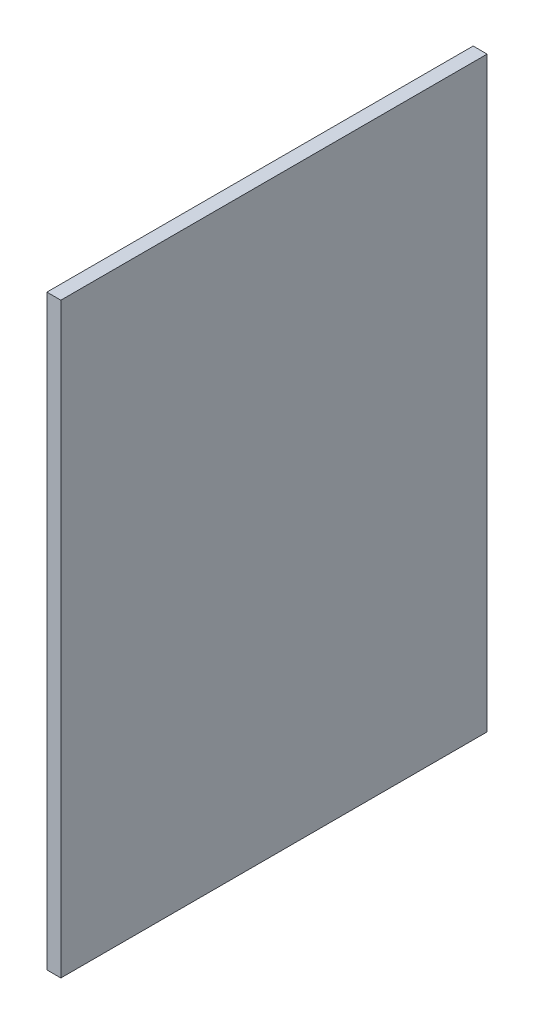
ISO-10303-21;
HEADER;
FILE_DESCRIPTION(('STEP AP214'),'2;1');
FILE_NAME('part.step','',(''),(''),'','','');
FILE_SCHEMA(('AUTOMOTIVE_DESIGN { 1 0 10303 214 1 1 1 1 }'));
ENDSEC;
DATA;
#1=APPLICATION_CONTEXT('core data for automotive mechanical design processes');
#2=APPLICATION_PROTOCOL_DEFINITION('international standard','automotive_design',2000,#1);
#3=PRODUCT_CONTEXT('',#1,'mechanical');
#4=PRODUCT('Part','Part','',(#3));
#5=PRODUCT_RELATED_PRODUCT_CATEGORY('part','',(#4));
#6=PRODUCT_DEFINITION_FORMATION('','',#4);
#7=PRODUCT_DEFINITION_CONTEXT('part definition',#1,'design');
#8=PRODUCT_DEFINITION('design','',#6,#7);
#9=PRODUCT_DEFINITION_SHAPE('','',#8);
#10=(LENGTH_UNIT() NAMED_UNIT(*) SI_UNIT(.MILLI.,.METRE.));
#11=(NAMED_UNIT(*) PLANE_ANGLE_UNIT() SI_UNIT($,.RADIAN.));
#12=(NAMED_UNIT(*) SI_UNIT($,.STERADIAN.) SOLID_ANGLE_UNIT());
#13=UNCERTAINTY_MEASURE_WITH_UNIT(LENGTH_MEASURE(1.E-05),#10,'distance_accuracy_value','');
#14=(GEOMETRIC_REPRESENTATION_CONTEXT(3) GLOBAL_UNCERTAINTY_ASSIGNED_CONTEXT((#13)) GLOBAL_UNIT_ASSIGNED_CONTEXT((#10,
#11,#12)) REPRESENTATION_CONTEXT('',''));
#15=CARTESIAN_POINT('',(0.,0.,0.));
#16=DIRECTION('',(0.,0.,1.));
#17=DIRECTION('',(1.,0.,0.));
#18=AXIS2_PLACEMENT_3D('',#15,#16,#17);
#19=CARTESIAN_POINT('',(39.6875,66.675,-173.0375));
#20=DIRECTION('',(0.,0.,-1.));
#21=DIRECTION('',(-1.,0.,0.));
#22=AXIS2_PLACEMENT_3D('',#19,#20,#21);
#23=PLANE('',#22);
#24=DIRECTION('',(1.,0.,0.));
#25=VECTOR('',#24,1.);
#26=CARTESIAN_POINT('',(39.6875,-66.675,-173.0375));
#27=LINE('',#26,#25);
#28=CARTESIAN_POINT('',(39.6875,-66.675,-173.0375));
#29=VERTEX_POINT('',#28);
#30=CARTESIAN_POINT('',(42.8625,-66.675,-173.0375));
#31=VERTEX_POINT('',#30);
#32=EDGE_CURVE('E98',#29,#31,#27,.T.);
#33=ORIENTED_EDGE('',*,*,#32,.F.);
#34=DIRECTION('',(0.,-1.,0.));
#35=VECTOR('',#34,1.);
#36=CARTESIAN_POINT('',(39.6875,66.675,-173.0375));
#37=LINE('',#36,#35);
#38=CARTESIAN_POINT('',(39.6875,66.675,-173.0375));
#39=VERTEX_POINT('',#38);
#40=EDGE_CURVE('E11',#39,#29,#37,.T.);
#41=ORIENTED_EDGE('',*,*,#40,.F.);
#42=DIRECTION('',(1.,0.,0.));
#43=VECTOR('',#42,1.);
#44=CARTESIAN_POINT('',(39.6875,66.675,-173.0375));
#45=LINE('',#44,#43);
#46=CARTESIAN_POINT('',(42.8625,66.675,-173.0375));
#47=VERTEX_POINT('',#46);
#48=EDGE_CURVE('E93',#39,#47,#45,.T.);
#49=ORIENTED_EDGE('',*,*,#48,.T.);
#50=DIRECTION('',(0.,-1.,0.));
#51=VECTOR('',#50,1.);
#52=CARTESIAN_POINT('',(42.8625,66.675,-173.0375));
#53=LINE('',#52,#51);
#54=EDGE_CURVE('E36',#47,#31,#53,.T.);
#55=ORIENTED_EDGE('',*,*,#54,.T.);
#56=EDGE_LOOP('',(#33,#41,#49,#55));
#57=FACE_BOUND('',#56,.T.);
#58=ADVANCED_FACE('F33',(#57),#23,.T.);
#59=CARTESIAN_POINT('',(39.6875,66.675,-173.0375));
#60=DIRECTION('',(1.,0.,0.));
#61=DIRECTION('',(0.,0.,-1.));
#62=AXIS2_PLACEMENT_3D('',#59,#60,#61);
#63=PLANE('',#62);
#64=DIRECTION('',(0.,0.,1.));
#65=VECTOR('',#64,1.);
#66=CARTESIAN_POINT('',(39.6875,-66.675,-173.0375));
#67=LINE('',#66,#65);
#68=CARTESIAN_POINT('',(39.6875,-66.675,-76.2));
#69=VERTEX_POINT('',#68);
#70=EDGE_CURVE('E66',#29,#69,#67,.T.);
#71=ORIENTED_EDGE('',*,*,#70,.T.);
#72=DIRECTION('',(0.,-1.,0.));
#73=VECTOR('',#72,1.);
#74=CARTESIAN_POINT('',(39.6875,66.675,-76.2));
#75=LINE('',#74,#73);
#76=CARTESIAN_POINT('',(39.6875,66.675,-76.2));
#77=VERTEX_POINT('',#76);
#78=EDGE_CURVE('E42',#77,#69,#75,.T.);
#79=ORIENTED_EDGE('',*,*,#78,.F.);
#80=DIRECTION('',(0.,0.,1.));
#81=VECTOR('',#80,1.);
#82=CARTESIAN_POINT('',(39.6875,66.675,-173.0375));
#83=LINE('',#82,#81);
#84=EDGE_CURVE('E83',#39,#77,#83,.T.);
#85=ORIENTED_EDGE('',*,*,#84,.F.);
#86=ORIENTED_EDGE('',*,*,#40,.T.);
#87=EDGE_LOOP('',(#71,#79,#85,#86));
#88=FACE_BOUND('',#87,.T.);
#89=ADVANCED_FACE('F108',(#88),#63,.F.);
#90=CARTESIAN_POINT('',(39.6875,66.675,-76.2));
#91=DIRECTION('',(0.,0.,-1.));
#92=DIRECTION('',(-1.,0.,0.));
#93=AXIS2_PLACEMENT_3D('',#90,#91,#92);
#94=PLANE('',#93);
#95=DIRECTION('',(1.,0.,0.));
#96=VECTOR('',#95,1.);
#97=CARTESIAN_POINT('',(39.6875,-66.675,-76.2));
#98=LINE('',#97,#96);
#99=CARTESIAN_POINT('',(42.8625,-66.675,-76.2));
#100=VERTEX_POINT('',#99);
#101=EDGE_CURVE('E90',#69,#100,#98,.T.);
#102=ORIENTED_EDGE('',*,*,#101,.T.);
#103=DIRECTION('',(0.,-1.,0.));
#104=VECTOR('',#103,1.);
#105=CARTESIAN_POINT('',(42.8625,66.675,-76.2));
#106=LINE('',#105,#104);
#107=CARTESIAN_POINT('',(42.8625,66.675,-76.2));
#108=VERTEX_POINT('',#107);
#109=EDGE_CURVE('E87',#108,#100,#106,.T.);
#110=ORIENTED_EDGE('',*,*,#109,.F.);
#111=DIRECTION('',(1.,0.,0.));
#112=VECTOR('',#111,1.);
#113=CARTESIAN_POINT('',(39.6875,66.675,-76.2));
#114=LINE('',#113,#112);
#115=EDGE_CURVE('E78',#77,#108,#114,.T.);
#116=ORIENTED_EDGE('',*,*,#115,.F.);
#117=ORIENTED_EDGE('',*,*,#78,.T.);
#118=EDGE_LOOP('',(#102,#110,#116,#117));
#119=FACE_BOUND('',#118,.T.);
#120=ADVANCED_FACE('F88',(#119),#94,.F.);
#121=CARTESIAN_POINT('',(42.8625,66.675,-173.0375));
#122=DIRECTION('',(1.,0.,0.));
#123=DIRECTION('',(0.,0.,-1.));
#124=AXIS2_PLACEMENT_3D('',#121,#122,#123);
#125=PLANE('',#124);
#126=DIRECTION('',(0.,0.,1.));
#127=VECTOR('',#126,1.);
#128=CARTESIAN_POINT('',(42.8625,-66.675,-173.0375));
#129=LINE('',#128,#127);
#130=EDGE_CURVE('E101',#31,#100,#129,.T.);
#131=ORIENTED_EDGE('',*,*,#130,.F.);
#132=ORIENTED_EDGE('',*,*,#54,.F.);
#133=DIRECTION('',(0.,0.,1.));
#134=VECTOR('',#133,1.);
#135=CARTESIAN_POINT('',(42.8625,66.675,-173.0375));
#136=LINE('',#135,#134);
#137=EDGE_CURVE('E82',#47,#108,#136,.T.);
#138=ORIENTED_EDGE('',*,*,#137,.T.);
#139=ORIENTED_EDGE('',*,*,#109,.T.);
#140=EDGE_LOOP('',(#131,#132,#138,#139));
#141=FACE_BOUND('',#140,.T.);
#142=ADVANCED_FACE('F92',(#141),#125,.T.);
#143=CARTESIAN_POINT('',(0.,66.675,0.));
#144=DIRECTION('',(0.,-1.,0.));
#145=DIRECTION('',(0.,0.,-1.));
#146=AXIS2_PLACEMENT_3D('',#143,#144,#145);
#147=PLANE('',#146);
#148=ORIENTED_EDGE('',*,*,#48,.F.);
#149=ORIENTED_EDGE('',*,*,#84,.T.);
#150=ORIENTED_EDGE('',*,*,#115,.T.);
#151=ORIENTED_EDGE('',*,*,#137,.F.);
#152=EDGE_LOOP('',(#148,#149,#150,#151));
#153=FACE_BOUND('',#152,.T.);
#154=ADVANCED_FACE('F81',(#153),#147,.F.);
#155=CARTESIAN_POINT('',(0.,-66.675,0.));
#156=DIRECTION('',(0.,-1.,0.));
#157=DIRECTION('',(0.,0.,-1.));
#158=AXIS2_PLACEMENT_3D('',#155,#156,#157);
#159=PLANE('',#158);
#160=ORIENTED_EDGE('',*,*,#32,.T.);
#161=ORIENTED_EDGE('',*,*,#130,.T.);
#162=ORIENTED_EDGE('',*,*,#101,.F.);
#163=ORIENTED_EDGE('',*,*,#70,.F.);
#164=EDGE_LOOP('',(#160,#161,#162,#163));
#165=FACE_BOUND('',#164,.T.);
#166=ADVANCED_FACE('F106',(#165),#159,.T.);
#167=CLOSED_SHELL('',(#58,#89,#120,#142,#154,#166));
#168=MANIFOLD_SOLID_BREP('B2',#167);
#169=ADVANCED_BREP_SHAPE_REPRESENTATION('',(#18,#168),#14);
#170=SHAPE_DEFINITION_REPRESENTATION(#9,#169);
ENDSEC;
END-ISO-10303-21;
